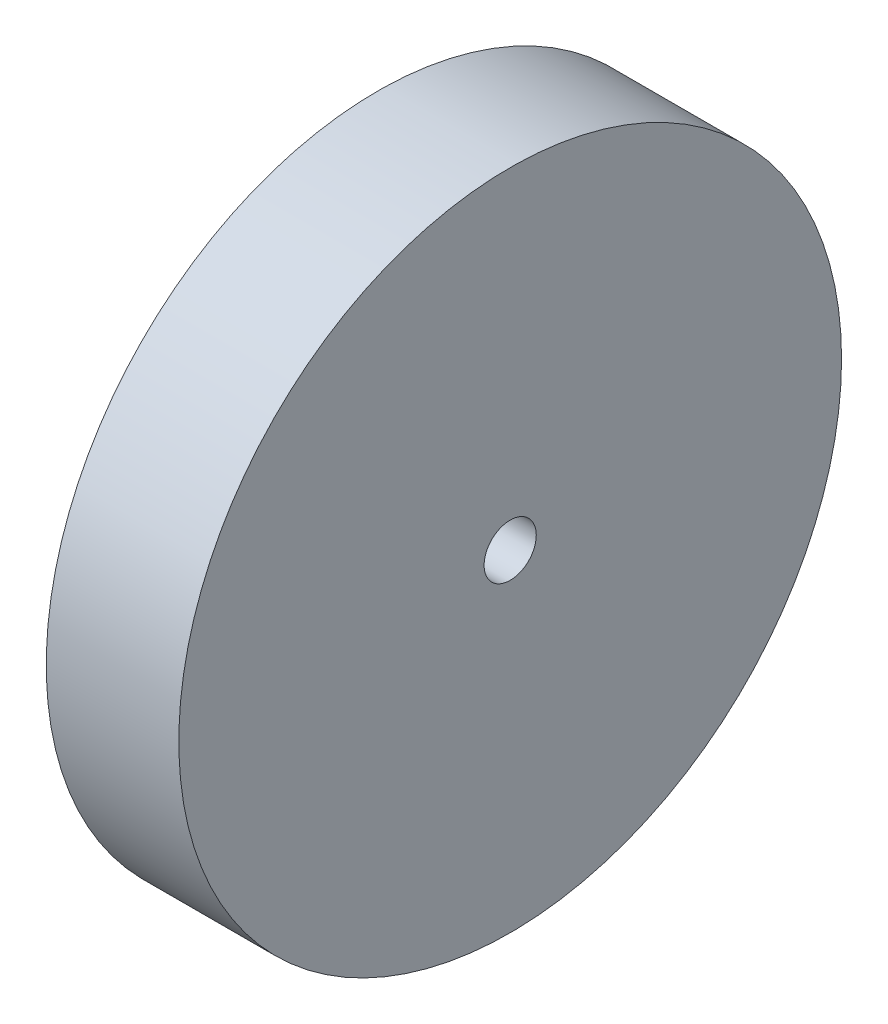
ISO-10303-21;
HEADER;
FILE_DESCRIPTION(('STEP AP214'),'2;1');
FILE_NAME('part.step','',(''),(''),'','','');
FILE_SCHEMA(('AUTOMOTIVE_DESIGN { 1 0 10303 214 1 1 1 1 }'));
ENDSEC;
DATA;
#1=APPLICATION_CONTEXT('core data for automotive mechanical design processes');
#2=APPLICATION_PROTOCOL_DEFINITION('international standard','automotive_design',2000,#1);
#3=PRODUCT_CONTEXT('',#1,'mechanical');
#4=PRODUCT('Part','Part','',(#3));
#5=PRODUCT_RELATED_PRODUCT_CATEGORY('part','',(#4));
#6=PRODUCT_DEFINITION_FORMATION('','',#4);
#7=PRODUCT_DEFINITION_CONTEXT('part definition',#1,'design');
#8=PRODUCT_DEFINITION('design','',#6,#7);
#9=PRODUCT_DEFINITION_SHAPE('','',#8);
#10=(LENGTH_UNIT() NAMED_UNIT(*) SI_UNIT(.MILLI.,.METRE.));
#11=(NAMED_UNIT(*) PLANE_ANGLE_UNIT() SI_UNIT($,.RADIAN.));
#12=(NAMED_UNIT(*) SI_UNIT($,.STERADIAN.) SOLID_ANGLE_UNIT());
#13=UNCERTAINTY_MEASURE_WITH_UNIT(LENGTH_MEASURE(1.E-05),#10,'distance_accuracy_value','');
#14=(GEOMETRIC_REPRESENTATION_CONTEXT(3) GLOBAL_UNCERTAINTY_ASSIGNED_CONTEXT((#13)) GLOBAL_UNIT_ASSIGNED_CONTEXT((#10,
#11,#12)) REPRESENTATION_CONTEXT('',''));
#15=CARTESIAN_POINT('',(0.,0.,0.));
#16=DIRECTION('',(0.,0.,1.));
#17=DIRECTION('',(1.,0.,0.));
#18=AXIS2_PLACEMENT_3D('',#15,#16,#17);
#19=CARTESIAN_POINT('',(12.7,0.,0.));
#20=DIRECTION('',(1.,0.,0.));
#21=DIRECTION('',(0.,0.,-1.));
#22=AXIS2_PLACEMENT_3D('',#19,#20,#21);
#23=PLANE('',#22);
#24=CARTESIAN_POINT('',(12.7,0.,0.));
#25=DIRECTION('',(1.,0.,0.));
#26=DIRECTION('',(0.,0.,-1.));
#27=AXIS2_PLACEMENT_3D('',#24,#25,#26);
#28=CIRCLE('',#27,31.75);
#29=CARTESIAN_POINT('',(12.7,0.,-31.75));
#30=VERTEX_POINT('',#29);
#31=EDGE_CURVE('E10',#30,#30,#28,.T.);
#32=ORIENTED_EDGE('',*,*,#31,.T.);
#33=EDGE_LOOP('',(#32));
#34=FACE_BOUND('',#33,.T.);
#35=CARTESIAN_POINT('',(12.7,0.,0.));
#36=DIRECTION('',(1.,0.,0.));
#37=DIRECTION('',(0.,0.,-1.));
#38=AXIS2_PLACEMENT_3D('',#35,#36,#37);
#39=CIRCLE('',#38,2.5);
#40=CARTESIAN_POINT('',(12.7,0.,-2.5));
#41=VERTEX_POINT('',#40);
#42=EDGE_CURVE('E50',#41,#41,#39,.T.);
#43=ORIENTED_EDGE('',*,*,#42,.F.);
#44=EDGE_LOOP('',(#43));
#45=FACE_BOUND('',#44,.T.);
#46=ADVANCED_FACE('F37',(#34,#45),#23,.T.);
#47=CARTESIAN_POINT('',(0.,0.,0.));
#48=DIRECTION('',(1.,0.,0.));
#49=DIRECTION('',(0.,0.,-1.));
#50=AXIS2_PLACEMENT_3D('',#47,#48,#49);
#51=PLANE('',#50);
#52=CARTESIAN_POINT('',(0.,0.,0.));
#53=DIRECTION('',(1.,0.,0.));
#54=DIRECTION('',(0.,0.,-1.));
#55=AXIS2_PLACEMENT_3D('',#52,#53,#54);
#56=CIRCLE('',#55,31.75);
#57=CARTESIAN_POINT('',(0.,0.,-31.75));
#58=VERTEX_POINT('',#57);
#59=EDGE_CURVE('E41',#58,#58,#56,.T.);
#60=ORIENTED_EDGE('',*,*,#59,.F.);
#61=EDGE_LOOP('',(#60));
#62=FACE_BOUND('',#61,.T.);
#63=CARTESIAN_POINT('',(0.,0.,0.));
#64=DIRECTION('',(1.,0.,0.));
#65=DIRECTION('',(0.,0.,-1.));
#66=AXIS2_PLACEMENT_3D('',#63,#64,#65);
#67=CIRCLE('',#66,2.5);
#68=CARTESIAN_POINT('',(0.,0.,-2.5));
#69=VERTEX_POINT('',#68);
#70=EDGE_CURVE('E52',#69,#69,#67,.T.);
#71=ORIENTED_EDGE('',*,*,#70,.T.);
#72=EDGE_LOOP('',(#71));
#73=FACE_BOUND('',#72,.T.);
#74=ADVANCED_FACE('F64',(#62,#73),#51,.F.);
#75=CARTESIAN_POINT('',(12.7,0.,0.));
#76=DIRECTION('',(-1.,0.,0.));
#77=DIRECTION('',(0.,0.,1.));
#78=AXIS2_PLACEMENT_3D('',#75,#76,#77);
#79=CYLINDRICAL_SURFACE('',#78,31.75);
#80=ORIENTED_EDGE('',*,*,#31,.F.);
#81=EDGE_LOOP('',(#80));
#82=FACE_BOUND('',#81,.T.);
#83=ORIENTED_EDGE('',*,*,#59,.T.);
#84=EDGE_LOOP('',(#83));
#85=FACE_BOUND('',#84,.T.);
#86=ADVANCED_FACE('F39',(#82,#85),#79,.T.);
#87=CARTESIAN_POINT('',(12.7,0.,0.));
#88=DIRECTION('',(-1.,0.,0.));
#89=DIRECTION('',(0.,0.,1.));
#90=AXIS2_PLACEMENT_3D('',#87,#88,#89);
#91=CYLINDRICAL_SURFACE('',#90,2.5);
#92=ORIENTED_EDGE('',*,*,#42,.T.);
#93=EDGE_LOOP('',(#92));
#94=FACE_BOUND('',#93,.T.);
#95=ORIENTED_EDGE('',*,*,#70,.F.);
#96=EDGE_LOOP('',(#95));
#97=FACE_BOUND('',#96,.T.);
#98=ADVANCED_FACE('F60',(#94,#97),#91,.F.);
#99=CLOSED_SHELL('',(#46,#74,#86,#98));
#100=MANIFOLD_SOLID_BREP('B2',#99);
#101=ADVANCED_BREP_SHAPE_REPRESENTATION('',(#18,#100),#14);
#102=SHAPE_DEFINITION_REPRESENTATION(#9,#101);
ENDSEC;
END-ISO-10303-21;
